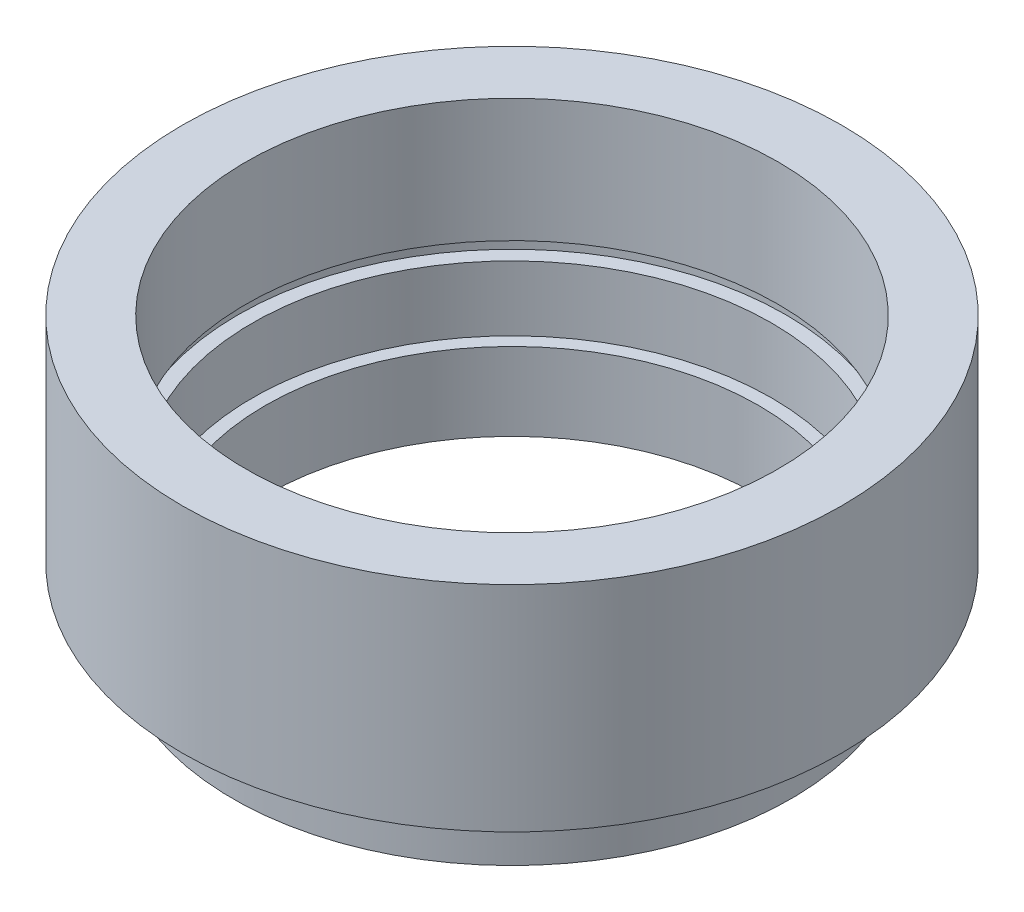
ISO-10303-21;
HEADER;
FILE_DESCRIPTION(('STEP AP214'),'2;1');
FILE_NAME('part.step','',(''),(''),'','','');
FILE_SCHEMA(('AUTOMOTIVE_DESIGN { 1 0 10303 214 1 1 1 1 }'));
ENDSEC;
DATA;
#1=APPLICATION_CONTEXT('core data for automotive mechanical design processes');
#2=APPLICATION_PROTOCOL_DEFINITION('international standard','automotive_design',2000,#1);
#3=PRODUCT_CONTEXT('',#1,'mechanical');
#4=PRODUCT('Part','Part','',(#3));
#5=PRODUCT_RELATED_PRODUCT_CATEGORY('part','',(#4));
#6=PRODUCT_DEFINITION_FORMATION('','',#4);
#7=PRODUCT_DEFINITION_CONTEXT('part definition',#1,'design');
#8=PRODUCT_DEFINITION('design','',#6,#7);
#9=PRODUCT_DEFINITION_SHAPE('','',#8);
#10=(LENGTH_UNIT() NAMED_UNIT(*) SI_UNIT(.MILLI.,.METRE.));
#11=(NAMED_UNIT(*) PLANE_ANGLE_UNIT() SI_UNIT($,.RADIAN.));
#12=(NAMED_UNIT(*) SI_UNIT($,.STERADIAN.) SOLID_ANGLE_UNIT());
#13=UNCERTAINTY_MEASURE_WITH_UNIT(LENGTH_MEASURE(1.E-05),#10,'distance_accuracy_value','');
#14=(GEOMETRIC_REPRESENTATION_CONTEXT(3) GLOBAL_UNCERTAINTY_ASSIGNED_CONTEXT((#13)) GLOBAL_UNIT_ASSIGNED_CONTEXT((#10,
#11,#12)) REPRESENTATION_CONTEXT('',''));
#15=CARTESIAN_POINT('',(0.,0.,0.));
#16=DIRECTION('',(0.,0.,1.));
#17=DIRECTION('',(1.,0.,0.));
#18=AXIS2_PLACEMENT_3D('',#15,#16,#17);
#19=CARTESIAN_POINT('',(0.,0.,0.));
#20=DIRECTION('',(0.,-1.,0.));
#21=DIRECTION('',(0.,0.,-1.));
#22=AXIS2_PLACEMENT_3D('',#19,#20,#21);
#23=CYLINDRICAL_SURFACE('',#22,19.);
#24=CARTESIAN_POINT('',(0.,0.,0.));
#25=DIRECTION('',(0.,-1.,0.));
#26=DIRECTION('',(0.,0.,-1.));
#27=AXIS2_PLACEMENT_3D('',#24,#25,#26);
#28=CIRCLE('',#27,19.);
#29=CARTESIAN_POINT('',(0.,0.,-19.));
#30=VERTEX_POINT('',#29);
#31=EDGE_CURVE('E10',#30,#30,#28,.T.);
#32=ORIENTED_EDGE('',*,*,#31,.T.);
#33=EDGE_LOOP('',(#32));
#34=FACE_BOUND('',#33,.T.);
#35=CARTESIAN_POINT('',(0.,6.,0.));
#36=DIRECTION('',(0.,-1.,0.));
#37=DIRECTION('',(0.,0.,-1.));
#38=AXIS2_PLACEMENT_3D('',#35,#36,#37);
#39=CIRCLE('',#38,19.);
#40=CARTESIAN_POINT('',(0.,6.,-19.));
#41=VERTEX_POINT('',#40);
#42=EDGE_CURVE('E79',#41,#41,#39,.T.);
#43=ORIENTED_EDGE('',*,*,#42,.F.);
#44=EDGE_LOOP('',(#43));
#45=FACE_BOUND('',#44,.T.);
#46=ADVANCED_FACE('F33',(#34,#45),#23,.F.);
#47=CARTESIAN_POINT('',(19.,0.,0.));
#48=DIRECTION('',(0.,-1.,0.));
#49=DIRECTION('',(0.,0.,-1.));
#50=AXIS2_PLACEMENT_3D('',#47,#48,#49);
#51=PLANE('',#50);
#52=CARTESIAN_POINT('',(0.,0.,0.));
#53=DIRECTION('',(0.,-1.,0.));
#54=DIRECTION('',(0.,0.,-1.));
#55=AXIS2_PLACEMENT_3D('',#52,#53,#54);
#56=CIRCLE('',#55,21.5);
#57=CARTESIAN_POINT('',(0.,0.,-21.5));
#58=VERTEX_POINT('',#57);
#59=EDGE_CURVE('E39',#58,#58,#56,.T.);
#60=ORIENTED_EDGE('',*,*,#59,.T.);
#61=EDGE_LOOP('',(#60));
#62=FACE_BOUND('',#61,.T.);
#63=ORIENTED_EDGE('',*,*,#31,.F.);
#64=EDGE_LOOP('',(#63));
#65=FACE_BOUND('',#64,.T.);
#66=ADVANCED_FACE('F87',(#62,#65),#51,.T.);
#67=CARTESIAN_POINT('',(0.,0.,0.));
#68=DIRECTION('',(0.,-1.,0.));
#69=DIRECTION('',(0.,0.,-1.));
#70=AXIS2_PLACEMENT_3D('',#67,#68,#69);
#71=CYLINDRICAL_SURFACE('',#70,21.5);
#72=CARTESIAN_POINT('',(0.,4.,0.));
#73=DIRECTION('',(0.,-1.,0.));
#74=DIRECTION('',(0.,0.,-1.));
#75=AXIS2_PLACEMENT_3D('',#72,#73,#74);
#76=CIRCLE('',#75,21.5);
#77=CARTESIAN_POINT('',(0.,4.,-21.5));
#78=VERTEX_POINT('',#77);
#79=EDGE_CURVE('E43',#78,#78,#76,.T.);
#80=ORIENTED_EDGE('',*,*,#79,.T.);
#81=EDGE_LOOP('',(#80));
#82=FACE_BOUND('',#81,.T.);
#83=ORIENTED_EDGE('',*,*,#59,.F.);
#84=EDGE_LOOP('',(#83));
#85=FACE_BOUND('',#84,.T.);
#86=ADVANCED_FACE('F91',(#82,#85),#71,.T.);
#87=CARTESIAN_POINT('',(21.5,4.,0.));
#88=DIRECTION('',(0.,1.,0.));
#89=DIRECTION('',(0.,0.,1.));
#90=AXIS2_PLACEMENT_3D('',#87,#88,#89);
#91=PLANE('',#90);
#92=CARTESIAN_POINT('',(0.,4.,0.));
#93=DIRECTION('',(0.,-1.,0.));
#94=DIRECTION('',(0.,0.,-1.));
#95=AXIS2_PLACEMENT_3D('',#92,#93,#94);
#96=CIRCLE('',#95,20.5);
#97=CARTESIAN_POINT('',(0.,4.,-20.5));
#98=VERTEX_POINT('',#97);
#99=EDGE_CURVE('E47',#98,#98,#96,.T.);
#100=ORIENTED_EDGE('',*,*,#99,.T.);
#101=EDGE_LOOP('',(#100));
#102=FACE_BOUND('',#101,.T.);
#103=ORIENTED_EDGE('',*,*,#79,.F.);
#104=EDGE_LOOP('',(#103));
#105=FACE_BOUND('',#104,.T.);
#106=ADVANCED_FACE('F95',(#102,#105),#91,.T.);
#107=CARTESIAN_POINT('',(0.,0.,0.));
#108=DIRECTION('',(0.,-1.,0.));
#109=DIRECTION('',(0.,0.,-1.));
#110=AXIS2_PLACEMENT_3D('',#107,#108,#109);
#111=CYLINDRICAL_SURFACE('',#110,20.5);
#112=CARTESIAN_POINT('',(0.,5.,0.));
#113=DIRECTION('',(0.,-1.,0.));
#114=DIRECTION('',(0.,0.,-1.));
#115=AXIS2_PLACEMENT_3D('',#112,#113,#114);
#116=CIRCLE('',#115,20.5);
#117=CARTESIAN_POINT('',(0.,5.,-20.5));
#118=VERTEX_POINT('',#117);
#119=EDGE_CURVE('E52',#118,#118,#116,.T.);
#120=ORIENTED_EDGE('',*,*,#119,.T.);
#121=EDGE_LOOP('',(#120));
#122=FACE_BOUND('',#121,.T.);
#123=ORIENTED_EDGE('',*,*,#99,.F.);
#124=EDGE_LOOP('',(#123));
#125=FACE_BOUND('',#124,.T.);
#126=ADVANCED_FACE('F102',(#122,#125),#111,.T.);
#127=CARTESIAN_POINT('',(20.5,5.,0.));
#128=DIRECTION('',(0.,-1.,0.));
#129=DIRECTION('',(0.,0.,-1.));
#130=AXIS2_PLACEMENT_3D('',#127,#128,#129);
#131=PLANE('',#130);
#132=CARTESIAN_POINT('',(0.,5.,0.));
#133=DIRECTION('',(0.,-1.,0.));
#134=DIRECTION('',(0.,0.,-1.));
#135=AXIS2_PLACEMENT_3D('',#132,#133,#134);
#136=CIRCLE('',#135,25.4);
#137=CARTESIAN_POINT('',(0.,5.,-25.4));
#138=VERTEX_POINT('',#137);
#139=EDGE_CURVE('E55',#138,#138,#136,.T.);
#140=ORIENTED_EDGE('',*,*,#139,.T.);
#141=EDGE_LOOP('',(#140));
#142=FACE_BOUND('',#141,.T.);
#143=ORIENTED_EDGE('',*,*,#119,.F.);
#144=EDGE_LOOP('',(#143));
#145=FACE_BOUND('',#144,.T.);
#146=ADVANCED_FACE('F106',(#142,#145),#131,.T.);
#147=CARTESIAN_POINT('',(0.,0.,0.));
#148=DIRECTION('',(0.,-1.,0.));
#149=DIRECTION('',(0.,0.,-1.));
#150=AXIS2_PLACEMENT_3D('',#147,#148,#149);
#151=CYLINDRICAL_SURFACE('',#150,25.4);
#152=CARTESIAN_POINT('',(0.,21.5,0.));
#153=DIRECTION('',(0.,-1.,0.));
#154=DIRECTION('',(0.,0.,-1.));
#155=AXIS2_PLACEMENT_3D('',#152,#153,#154);
#156=CIRCLE('',#155,25.4);
#157=CARTESIAN_POINT('',(0.,21.5,-25.4));
#158=VERTEX_POINT('',#157);
#159=EDGE_CURVE('E58',#158,#158,#156,.T.);
#160=ORIENTED_EDGE('',*,*,#159,.T.);
#161=EDGE_LOOP('',(#160));
#162=FACE_BOUND('',#161,.T.);
#163=ORIENTED_EDGE('',*,*,#139,.F.);
#164=EDGE_LOOP('',(#163));
#165=FACE_BOUND('',#164,.T.);
#166=ADVANCED_FACE('F110',(#162,#165),#151,.T.);
#167=CARTESIAN_POINT('',(25.4,21.5,0.));
#168=DIRECTION('',(0.,1.,0.));
#169=DIRECTION('',(0.,0.,1.));
#170=AXIS2_PLACEMENT_3D('',#167,#168,#169);
#171=PLANE('',#170);
#172=CARTESIAN_POINT('',(0.,21.5,0.));
#173=DIRECTION('',(0.,-1.,0.));
#174=DIRECTION('',(0.,0.,-1.));
#175=AXIS2_PLACEMENT_3D('',#172,#173,#174);
#176=CIRCLE('',#175,20.5);
#177=CARTESIAN_POINT('',(0.,21.5,-20.5));
#178=VERTEX_POINT('',#177);
#179=EDGE_CURVE('E61',#178,#178,#176,.T.);
#180=ORIENTED_EDGE('',*,*,#179,.T.);
#181=EDGE_LOOP('',(#180));
#182=FACE_BOUND('',#181,.T.);
#183=ORIENTED_EDGE('',*,*,#159,.F.);
#184=EDGE_LOOP('',(#183));
#185=FACE_BOUND('',#184,.T.);
#186=ADVANCED_FACE('F114',(#182,#185),#171,.T.);
#187=CARTESIAN_POINT('',(0.,0.,0.));
#188=DIRECTION('',(0.,-1.,0.));
#189=DIRECTION('',(0.,0.,-1.));
#190=AXIS2_PLACEMENT_3D('',#187,#188,#189);
#191=CYLINDRICAL_SURFACE('',#190,20.5);
#192=CARTESIAN_POINT('',(0.,12.,0.));
#193=DIRECTION('',(0.,-1.,0.));
#194=DIRECTION('',(0.,0.,-1.));
#195=AXIS2_PLACEMENT_3D('',#192,#193,#194);
#196=CIRCLE('',#195,20.5);
#197=CARTESIAN_POINT('',(0.,12.,-20.5));
#198=VERTEX_POINT('',#197);
#199=EDGE_CURVE('E64',#198,#198,#196,.T.);
#200=ORIENTED_EDGE('',*,*,#199,.T.);
#201=EDGE_LOOP('',(#200));
#202=FACE_BOUND('',#201,.T.);
#203=ORIENTED_EDGE('',*,*,#179,.F.);
#204=EDGE_LOOP('',(#203));
#205=FACE_BOUND('',#204,.T.);
#206=ADVANCED_FACE('F118',(#202,#205),#191,.F.);
#207=CARTESIAN_POINT('',(20.5,12.,0.));
#208=DIRECTION('',(0.,-1.,0.));
#209=DIRECTION('',(0.,0.,-1.));
#210=AXIS2_PLACEMENT_3D('',#207,#208,#209);
#211=PLANE('',#210);
#212=CARTESIAN_POINT('',(0.,12.,0.));
#213=DIRECTION('',(0.,-1.,0.));
#214=DIRECTION('',(0.,0.,-1.));
#215=AXIS2_PLACEMENT_3D('',#212,#213,#214);
#216=CIRCLE('',#215,21.1);
#217=CARTESIAN_POINT('',(0.,12.,-21.1));
#218=VERTEX_POINT('',#217);
#219=EDGE_CURVE('E67',#218,#218,#216,.T.);
#220=ORIENTED_EDGE('',*,*,#219,.T.);
#221=EDGE_LOOP('',(#220));
#222=FACE_BOUND('',#221,.T.);
#223=ORIENTED_EDGE('',*,*,#199,.F.);
#224=EDGE_LOOP('',(#223));
#225=FACE_BOUND('',#224,.T.);
#226=ADVANCED_FACE('F122',(#222,#225),#211,.T.);
#227=CARTESIAN_POINT('',(0.,0.,0.));
#228=DIRECTION('',(0.,-1.,0.));
#229=DIRECTION('',(0.,0.,-1.));
#230=AXIS2_PLACEMENT_3D('',#227,#228,#229);
#231=CYLINDRICAL_SURFACE('',#230,21.1);
#232=CARTESIAN_POINT('',(0.,11.,0.));
#233=DIRECTION('',(0.,-1.,0.));
#234=DIRECTION('',(0.,0.,-1.));
#235=AXIS2_PLACEMENT_3D('',#232,#233,#234);
#236=CIRCLE('',#235,21.1);
#237=CARTESIAN_POINT('',(0.,11.,-21.1));
#238=VERTEX_POINT('',#237);
#239=EDGE_CURVE('E70',#238,#238,#236,.T.);
#240=ORIENTED_EDGE('',*,*,#239,.T.);
#241=EDGE_LOOP('',(#240));
#242=FACE_BOUND('',#241,.T.);
#243=ORIENTED_EDGE('',*,*,#219,.F.);
#244=EDGE_LOOP('',(#243));
#245=FACE_BOUND('',#244,.T.);
#246=ADVANCED_FACE('F126',(#242,#245),#231,.F.);
#247=CARTESIAN_POINT('',(21.1,11.,0.));
#248=DIRECTION('',(0.,1.,0.));
#249=DIRECTION('',(0.,0.,1.));
#250=AXIS2_PLACEMENT_3D('',#247,#248,#249);
#251=PLANE('',#250);
#252=CARTESIAN_POINT('',(0.,11.,0.));
#253=DIRECTION('',(0.,-1.,0.));
#254=DIRECTION('',(0.,0.,-1.));
#255=AXIS2_PLACEMENT_3D('',#252,#253,#254);
#256=CIRCLE('',#255,20.);
#257=CARTESIAN_POINT('',(0.,11.,-20.));
#258=VERTEX_POINT('',#257);
#259=EDGE_CURVE('E73',#258,#258,#256,.T.);
#260=ORIENTED_EDGE('',*,*,#259,.T.);
#261=EDGE_LOOP('',(#260));
#262=FACE_BOUND('',#261,.T.);
#263=ORIENTED_EDGE('',*,*,#239,.F.);
#264=EDGE_LOOP('',(#263));
#265=FACE_BOUND('',#264,.T.);
#266=ADVANCED_FACE('F130',(#262,#265),#251,.T.);
#267=CARTESIAN_POINT('',(0.,0.,0.));
#268=DIRECTION('',(0.,-1.,0.));
#269=DIRECTION('',(0.,0.,-1.));
#270=AXIS2_PLACEMENT_3D('',#267,#268,#269);
#271=CYLINDRICAL_SURFACE('',#270,20.);
#272=CARTESIAN_POINT('',(0.,6.,0.));
#273=DIRECTION('',(0.,-1.,0.));
#274=DIRECTION('',(0.,0.,-1.));
#275=AXIS2_PLACEMENT_3D('',#272,#273,#274);
#276=CIRCLE('',#275,20.);
#277=CARTESIAN_POINT('',(0.,6.,-20.));
#278=VERTEX_POINT('',#277);
#279=EDGE_CURVE('E76',#278,#278,#276,.T.);
#280=ORIENTED_EDGE('',*,*,#279,.T.);
#281=EDGE_LOOP('',(#280));
#282=FACE_BOUND('',#281,.T.);
#283=ORIENTED_EDGE('',*,*,#259,.F.);
#284=EDGE_LOOP('',(#283));
#285=FACE_BOUND('',#284,.T.);
#286=ADVANCED_FACE('F134',(#282,#285),#271,.F.);
#287=CARTESIAN_POINT('',(20.,6.,0.));
#288=DIRECTION('',(0.,1.,0.));
#289=DIRECTION('',(0.,0.,1.));
#290=AXIS2_PLACEMENT_3D('',#287,#288,#289);
#291=PLANE('',#290);
#292=ORIENTED_EDGE('',*,*,#42,.T.);
#293=EDGE_LOOP('',(#292));
#294=FACE_BOUND('',#293,.T.);
#295=ORIENTED_EDGE('',*,*,#279,.F.);
#296=EDGE_LOOP('',(#295));
#297=FACE_BOUND('',#296,.T.);
#298=ADVANCED_FACE('F83',(#294,#297),#291,.T.);
#299=CLOSED_SHELL('',(#46,#66,#86,#106,#126,#146,#166,#186,#206,#226,#246,#266,#286,#298));
#300=MANIFOLD_SOLID_BREP('B2',#299);
#301=ADVANCED_BREP_SHAPE_REPRESENTATION('',(#18,#300),#14);
#302=SHAPE_DEFINITION_REPRESENTATION(#9,#301);
ENDSEC;
END-ISO-10303-21;
